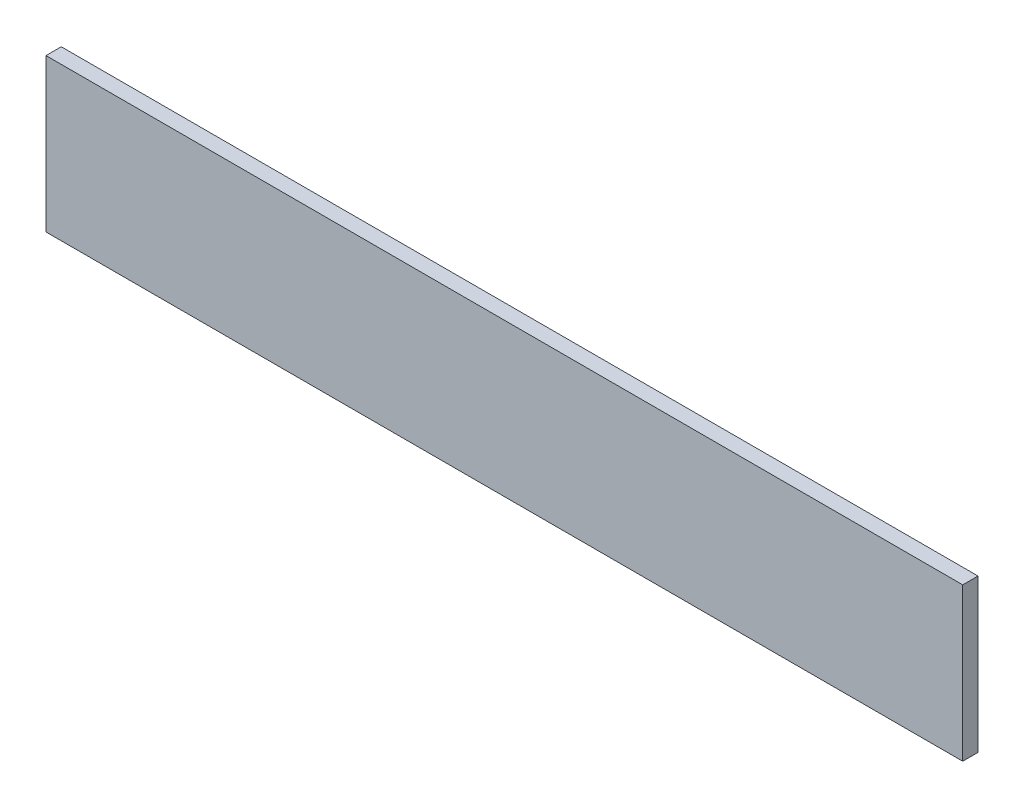
ISO-10303-21;
HEADER;
FILE_DESCRIPTION(('STEP AP214'),'2;1');
FILE_NAME('part.step','',(''),(''),'','','');
FILE_SCHEMA(('AUTOMOTIVE_DESIGN { 1 0 10303 214 1 1 1 1 }'));
ENDSEC;
DATA;
#1=APPLICATION_CONTEXT('core data for automotive mechanical design processes');
#2=APPLICATION_PROTOCOL_DEFINITION('international standard','automotive_design',2000,#1);
#3=PRODUCT_CONTEXT('',#1,'mechanical');
#4=PRODUCT('Part','Part','',(#3));
#5=PRODUCT_RELATED_PRODUCT_CATEGORY('part','',(#4));
#6=PRODUCT_DEFINITION_FORMATION('','',#4);
#7=PRODUCT_DEFINITION_CONTEXT('part definition',#1,'design');
#8=PRODUCT_DEFINITION('design','',#6,#7);
#9=PRODUCT_DEFINITION_SHAPE('','',#8);
#10=(LENGTH_UNIT() NAMED_UNIT(*) SI_UNIT(.MILLI.,.METRE.));
#11=(NAMED_UNIT(*) PLANE_ANGLE_UNIT() SI_UNIT($,.RADIAN.));
#12=(NAMED_UNIT(*) SI_UNIT($,.STERADIAN.) SOLID_ANGLE_UNIT());
#13=UNCERTAINTY_MEASURE_WITH_UNIT(LENGTH_MEASURE(1.E-05),#10,'distance_accuracy_value','');
#14=(GEOMETRIC_REPRESENTATION_CONTEXT(3) GLOBAL_UNCERTAINTY_ASSIGNED_CONTEXT((#13)) GLOBAL_UNIT_ASSIGNED_CONTEXT((#10,
#11,#12)) REPRESENTATION_CONTEXT('',''));
#15=CARTESIAN_POINT('',(0.,0.,0.));
#16=DIRECTION('',(0.,0.,1.));
#17=DIRECTION('',(1.,0.,0.));
#18=AXIS2_PLACEMENT_3D('',#15,#16,#17);
#19=CARTESIAN_POINT('',(0.,0.,2.));
#20=DIRECTION('',(1.,0.,0.));
#21=DIRECTION('',(0.,1.,0.));
#22=AXIS2_PLACEMENT_3D('',#19,#20,#21);
#23=PLANE('',#22);
#24=DIRECTION('',(0.,-1.,0.));
#25=VECTOR('',#24,1.);
#26=CARTESIAN_POINT('',(0.,0.,0.));
#27=LINE('',#26,#25);
#28=CARTESIAN_POINT('',(0.,0.,0.));
#29=VERTEX_POINT('',#28);
#30=CARTESIAN_POINT('',(0.,-20.,0.));
#31=VERTEX_POINT('',#30);
#32=EDGE_CURVE('E101',#29,#31,#27,.T.);
#33=ORIENTED_EDGE('',*,*,#32,.T.);
#34=DIRECTION('',(0.,0.,-1.));
#35=VECTOR('',#34,1.);
#36=CARTESIAN_POINT('',(0.,-20.,2.));
#37=LINE('',#36,#35);
#38=CARTESIAN_POINT('',(0.,-20.,2.));
#39=VERTEX_POINT('',#38);
#40=EDGE_CURVE('E11',#39,#31,#37,.T.);
#41=ORIENTED_EDGE('',*,*,#40,.F.);
#42=DIRECTION('',(0.,-1.,0.));
#43=VECTOR('',#42,1.);
#44=CARTESIAN_POINT('',(0.,0.,2.));
#45=LINE('',#44,#43);
#46=CARTESIAN_POINT('',(0.,0.,2.));
#47=VERTEX_POINT('',#46);
#48=EDGE_CURVE('E89',#47,#39,#45,.T.);
#49=ORIENTED_EDGE('',*,*,#48,.F.);
#50=DIRECTION('',(0.,0.,-1.));
#51=VECTOR('',#50,1.);
#52=CARTESIAN_POINT('',(0.,0.,2.));
#53=LINE('',#52,#51);
#54=EDGE_CURVE('E97',#47,#29,#53,.T.);
#55=ORIENTED_EDGE('',*,*,#54,.T.);
#56=EDGE_LOOP('',(#33,#41,#49,#55));
#57=FACE_BOUND('',#56,.T.);
#58=ADVANCED_FACE('F38',(#57),#23,.F.);
#59=CARTESIAN_POINT('',(0.,-20.,2.));
#60=DIRECTION('',(0.,1.,0.));
#61=DIRECTION('',(0.,0.,1.));
#62=AXIS2_PLACEMENT_3D('',#59,#60,#61);
#63=PLANE('',#62);
#64=DIRECTION('',(1.,0.,0.));
#65=VECTOR('',#64,1.);
#66=CARTESIAN_POINT('',(0.,-20.,0.));
#67=LINE('',#66,#65);
#68=CARTESIAN_POINT('',(120.,-20.,0.));
#69=VERTEX_POINT('',#68);
#70=EDGE_CURVE('E93',#31,#69,#67,.T.);
#71=ORIENTED_EDGE('',*,*,#70,.T.);
#72=DIRECTION('',(0.,0.,-1.));
#73=VECTOR('',#72,1.);
#74=CARTESIAN_POINT('',(120.,-20.,2.));
#75=LINE('',#74,#73);
#76=CARTESIAN_POINT('',(120.,-20.,2.));
#77=VERTEX_POINT('',#76);
#78=EDGE_CURVE('E46',#77,#69,#75,.T.);
#79=ORIENTED_EDGE('',*,*,#78,.F.);
#80=DIRECTION('',(1.,0.,0.));
#81=VECTOR('',#80,1.);
#82=CARTESIAN_POINT('',(0.,-20.,2.));
#83=LINE('',#82,#81);
#84=EDGE_CURVE('E84',#39,#77,#83,.T.);
#85=ORIENTED_EDGE('',*,*,#84,.F.);
#86=ORIENTED_EDGE('',*,*,#40,.T.);
#87=EDGE_LOOP('',(#71,#79,#85,#86));
#88=FACE_BOUND('',#87,.T.);
#89=ADVANCED_FACE('F92',(#88),#63,.F.);
#90=CARTESIAN_POINT('',(120.,0.,2.));
#91=DIRECTION('',(-1.,0.,0.));
#92=DIRECTION('',(0.,0.,1.));
#93=AXIS2_PLACEMENT_3D('',#90,#91,#92);
#94=PLANE('',#93);
#95=DIRECTION('',(0.,1.,0.));
#96=VECTOR('',#95,1.);
#97=CARTESIAN_POINT('',(120.,0.,0.));
#98=LINE('',#97,#96);
#99=CARTESIAN_POINT('',(120.,0.,0.));
#100=VERTEX_POINT('',#99);
#101=EDGE_CURVE('E71',#69,#100,#98,.T.);
#102=ORIENTED_EDGE('',*,*,#101,.T.);
#103=DIRECTION('',(0.,0.,-1.));
#104=VECTOR('',#103,1.);
#105=CARTESIAN_POINT('',(120.,0.,2.));
#106=LINE('',#105,#104);
#107=CARTESIAN_POINT('',(120.,0.,2.));
#108=VERTEX_POINT('',#107);
#109=EDGE_CURVE('E94',#108,#100,#106,.T.);
#110=ORIENTED_EDGE('',*,*,#109,.F.);
#111=DIRECTION('',(0.,1.,0.));
#112=VECTOR('',#111,1.);
#113=CARTESIAN_POINT('',(120.,0.,2.));
#114=LINE('',#113,#112);
#115=EDGE_CURVE('E87',#77,#108,#114,.T.);
#116=ORIENTED_EDGE('',*,*,#115,.F.);
#117=ORIENTED_EDGE('',*,*,#78,.T.);
#118=EDGE_LOOP('',(#102,#110,#116,#117));
#119=FACE_BOUND('',#118,.T.);
#120=ADVANCED_FACE('F95',(#119),#94,.F.);
#121=CARTESIAN_POINT('',(0.,0.,2.));
#122=DIRECTION('',(0.,-1.,0.));
#123=DIRECTION('',(0.,0.,-1.));
#124=AXIS2_PLACEMENT_3D('',#121,#122,#123);
#125=PLANE('',#124);
#126=DIRECTION('',(-1.,0.,0.));
#127=VECTOR('',#126,1.);
#128=CARTESIAN_POINT('',(0.,0.,0.));
#129=LINE('',#128,#127);
#130=EDGE_CURVE('E77',#100,#29,#129,.T.);
#131=ORIENTED_EDGE('',*,*,#130,.T.);
#132=ORIENTED_EDGE('',*,*,#54,.F.);
#133=DIRECTION('',(-1.,0.,0.));
#134=VECTOR('',#133,1.);
#135=CARTESIAN_POINT('',(0.,0.,2.));
#136=LINE('',#135,#134);
#137=EDGE_CURVE('E54',#108,#47,#136,.T.);
#138=ORIENTED_EDGE('',*,*,#137,.F.);
#139=ORIENTED_EDGE('',*,*,#109,.T.);
#140=EDGE_LOOP('',(#131,#132,#138,#139));
#141=FACE_BOUND('',#140,.T.);
#142=ADVANCED_FACE('F108',(#141),#125,.F.);
#143=CARTESIAN_POINT('',(0.,0.,2.));
#144=DIRECTION('',(0.,0.,1.));
#145=DIRECTION('',(1.,0.,0.));
#146=AXIS2_PLACEMENT_3D('',#143,#144,#145);
#147=PLANE('',#146);
#148=ORIENTED_EDGE('',*,*,#48,.T.);
#149=ORIENTED_EDGE('',*,*,#84,.T.);
#150=ORIENTED_EDGE('',*,*,#115,.T.);
#151=ORIENTED_EDGE('',*,*,#137,.T.);
#152=EDGE_LOOP('',(#148,#149,#150,#151));
#153=FACE_BOUND('',#152,.T.);
#154=ADVANCED_FACE('F85',(#153),#147,.T.);
#155=CARTESIAN_POINT('',(0.,0.,0.));
#156=DIRECTION('',(0.,0.,1.));
#157=DIRECTION('',(1.,0.,0.));
#158=AXIS2_PLACEMENT_3D('',#155,#156,#157);
#159=PLANE('',#158);
#160=ORIENTED_EDGE('',*,*,#32,.F.);
#161=ORIENTED_EDGE('',*,*,#130,.F.);
#162=ORIENTED_EDGE('',*,*,#101,.F.);
#163=ORIENTED_EDGE('',*,*,#70,.F.);
#164=EDGE_LOOP('',(#160,#161,#162,#163));
#165=FACE_BOUND('',#164,.T.);
#166=ADVANCED_FACE('F111',(#165),#159,.F.);
#167=CLOSED_SHELL('',(#58,#89,#120,#142,#154,#166));
#168=MANIFOLD_SOLID_BREP('B2',#167);
#169=ADVANCED_BREP_SHAPE_REPRESENTATION('',(#18,#168),#14);
#170=SHAPE_DEFINITION_REPRESENTATION(#9,#169);
ENDSEC;
END-ISO-10303-21;
